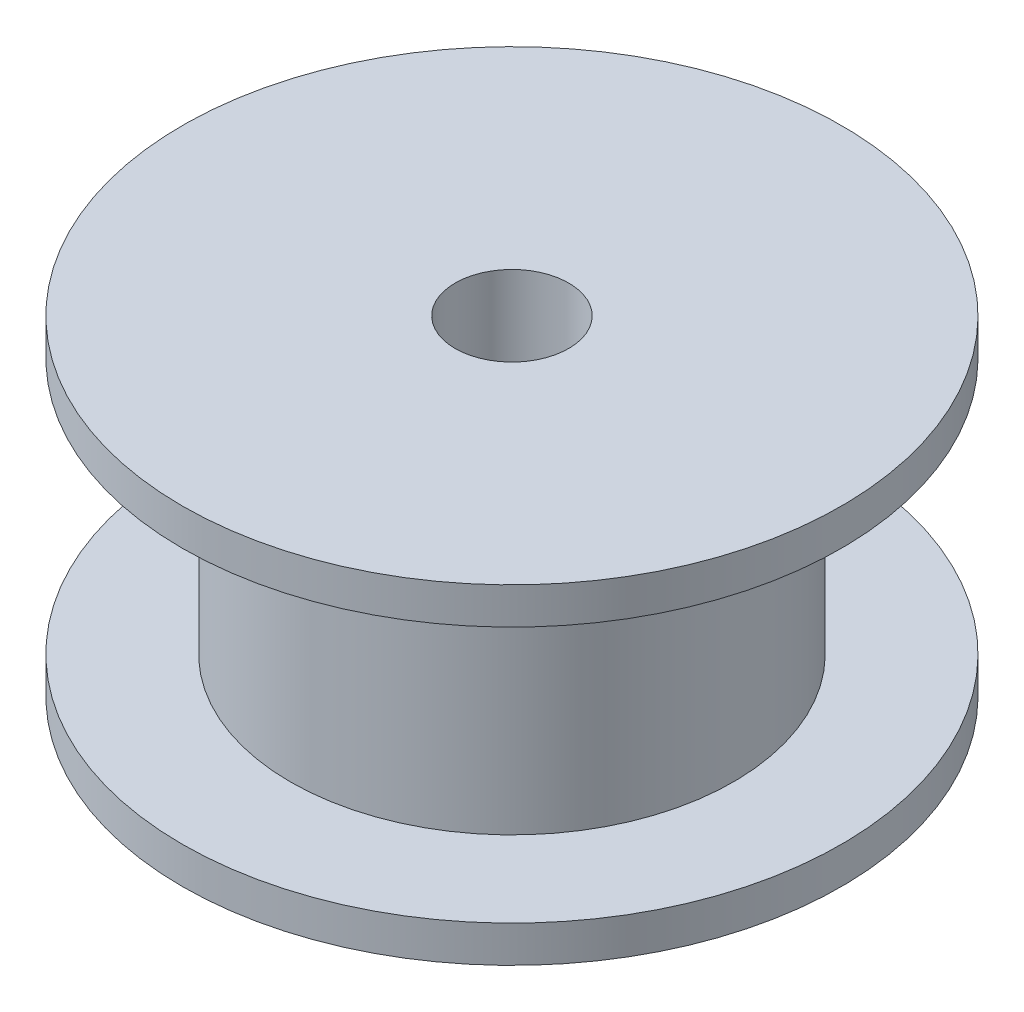
ISO-10303-21;
HEADER;
FILE_DESCRIPTION(('STEP AP214'),'2;1');
FILE_NAME('part.step','',(''),(''),'','','');
FILE_SCHEMA(('AUTOMOTIVE_DESIGN { 1 0 10303 214 1 1 1 1 }'));
ENDSEC;
DATA;
#1=APPLICATION_CONTEXT('core data for automotive mechanical design processes');
#2=APPLICATION_PROTOCOL_DEFINITION('international standard','automotive_design',2000,#1);
#3=PRODUCT_CONTEXT('',#1,'mechanical');
#4=PRODUCT('Part','Part','',(#3));
#5=PRODUCT_RELATED_PRODUCT_CATEGORY('part','',(#4));
#6=PRODUCT_DEFINITION_FORMATION('','',#4);
#7=PRODUCT_DEFINITION_CONTEXT('part definition',#1,'design');
#8=PRODUCT_DEFINITION('design','',#6,#7);
#9=PRODUCT_DEFINITION_SHAPE('','',#8);
#10=(LENGTH_UNIT() NAMED_UNIT(*) SI_UNIT(.MILLI.,.METRE.));
#11=(NAMED_UNIT(*) PLANE_ANGLE_UNIT() SI_UNIT($,.RADIAN.));
#12=(NAMED_UNIT(*) SI_UNIT($,.STERADIAN.) SOLID_ANGLE_UNIT());
#13=UNCERTAINTY_MEASURE_WITH_UNIT(LENGTH_MEASURE(1.E-05),#10,'distance_accuracy_value','');
#14=(GEOMETRIC_REPRESENTATION_CONTEXT(3) GLOBAL_UNCERTAINTY_ASSIGNED_CONTEXT((#13)) GLOBAL_UNIT_ASSIGNED_CONTEXT((#10,
#11,#12)) REPRESENTATION_CONTEXT('',''));
#15=CARTESIAN_POINT('',(0.,0.,0.));
#16=DIRECTION('',(0.,0.,1.));
#17=DIRECTION('',(1.,0.,0.));
#18=AXIS2_PLACEMENT_3D('',#15,#16,#17);
#19=CARTESIAN_POINT('',(0.,1.,0.));
#20=DIRECTION('',(0.,1.,0.));
#21=DIRECTION('',(0.,0.,1.));
#22=AXIS2_PLACEMENT_3D('',#19,#20,#21);
#23=PLANE('',#22);
#24=CARTESIAN_POINT('',(0.,1.,0.));
#25=DIRECTION('',(0.,1.,0.));
#26=DIRECTION('',(0.,0.,1.));
#27=AXIS2_PLACEMENT_3D('',#24,#25,#26);
#28=CIRCLE('',#27,9.);
#29=CARTESIAN_POINT('',(0.,1.,9.));
#30=VERTEX_POINT('',#29);
#31=EDGE_CURVE('E11',#30,#30,#28,.T.);
#32=ORIENTED_EDGE('',*,*,#31,.T.);
#33=EDGE_LOOP('',(#32));
#34=FACE_BOUND('',#33,.T.);
#35=CARTESIAN_POINT('',(0.,1.,0.));
#36=DIRECTION('',(0.,1.,0.));
#37=DIRECTION('',(0.,0.,1.));
#38=AXIS2_PLACEMENT_3D('',#35,#36,#37);
#39=CIRCLE('',#38,6.05);
#40=CARTESIAN_POINT('',(0.,1.,6.05));
#41=VERTEX_POINT('',#40);
#42=EDGE_CURVE('E52',#41,#41,#39,.F.);
#43=ORIENTED_EDGE('',*,*,#42,.T.);
#44=EDGE_LOOP('',(#43));
#45=FACE_BOUND('',#44,.T.);
#46=ADVANCED_FACE('F38',(#34,#45),#23,.T.);
#47=CARTESIAN_POINT('',(0.,1.,0.));
#48=DIRECTION('',(0.,-1.,0.));
#49=DIRECTION('',(0.,0.,-1.));
#50=AXIS2_PLACEMENT_3D('',#47,#48,#49);
#51=CYLINDRICAL_SURFACE('',#50,1.55);
#52=CARTESIAN_POINT('',(0.,0.,0.));
#53=DIRECTION('',(0.,1.,0.));
#54=DIRECTION('',(0.,0.,1.));
#55=AXIS2_PLACEMENT_3D('',#52,#53,#54);
#56=CIRCLE('',#55,1.55);
#57=CARTESIAN_POINT('',(0.,0.,1.55));
#58=VERTEX_POINT('',#57);
#59=EDGE_CURVE('E50',#58,#58,#56,.T.);
#60=ORIENTED_EDGE('',*,*,#59,.F.);
#61=EDGE_LOOP('',(#60));
#62=FACE_BOUND('',#61,.T.);
#63=CARTESIAN_POINT('',(0.,9.,0.));
#64=DIRECTION('',(0.,1.,0.));
#65=DIRECTION('',(0.,0.,1.));
#66=AXIS2_PLACEMENT_3D('',#63,#64,#65);
#67=CIRCLE('',#66,1.55);
#68=CARTESIAN_POINT('',(0.,9.,1.55));
#69=VERTEX_POINT('',#68);
#70=EDGE_CURVE('E62',#69,#69,#67,.F.);
#71=ORIENTED_EDGE('',*,*,#70,.F.);
#72=EDGE_LOOP('',(#71));
#73=FACE_BOUND('',#72,.T.);
#74=ADVANCED_FACE('F40',(#62,#73),#51,.F.);
#75=CARTESIAN_POINT('',(0.,1.,0.));
#76=DIRECTION('',(0.,-1.,0.));
#77=DIRECTION('',(0.,0.,-1.));
#78=AXIS2_PLACEMENT_3D('',#75,#76,#77);
#79=CYLINDRICAL_SURFACE('',#78,9.);
#80=ORIENTED_EDGE('',*,*,#31,.F.);
#81=EDGE_LOOP('',(#80));
#82=FACE_BOUND('',#81,.T.);
#83=CARTESIAN_POINT('',(0.,0.,0.));
#84=DIRECTION('',(0.,1.,0.));
#85=DIRECTION('',(0.,0.,1.));
#86=AXIS2_PLACEMENT_3D('',#83,#84,#85);
#87=CIRCLE('',#86,9.);
#88=CARTESIAN_POINT('',(0.,0.,9.));
#89=VERTEX_POINT('',#88);
#90=EDGE_CURVE('E42',#89,#89,#87,.T.);
#91=ORIENTED_EDGE('',*,*,#90,.T.);
#92=EDGE_LOOP('',(#91));
#93=FACE_BOUND('',#92,.T.);
#94=ADVANCED_FACE('F97',(#82,#93),#79,.T.);
#95=CARTESIAN_POINT('',(0.,0.,0.));
#96=DIRECTION('',(0.,1.,0.));
#97=DIRECTION('',(0.,0.,1.));
#98=AXIS2_PLACEMENT_3D('',#95,#96,#97);
#99=PLANE('',#98);
#100=ORIENTED_EDGE('',*,*,#59,.T.);
#101=EDGE_LOOP('',(#100));
#102=FACE_BOUND('',#101,.T.);
#103=ORIENTED_EDGE('',*,*,#90,.F.);
#104=EDGE_LOOP('',(#103));
#105=FACE_BOUND('',#104,.T.);
#106=ADVANCED_FACE('F101',(#102,#105),#99,.F.);
#107=CARTESIAN_POINT('',(0.,8.,0.));
#108=DIRECTION('',(0.,-1.,0.));
#109=DIRECTION('',(0.,0.,-1.));
#110=AXIS2_PLACEMENT_3D('',#107,#108,#109);
#111=CYLINDRICAL_SURFACE('',#110,6.05);
#112=ORIENTED_EDGE('',*,*,#42,.F.);
#113=EDGE_LOOP('',(#112));
#114=FACE_BOUND('',#113,.T.);
#115=CARTESIAN_POINT('',(0.,8.,0.));
#116=DIRECTION('',(0.,1.,0.));
#117=DIRECTION('',(0.,0.,1.));
#118=AXIS2_PLACEMENT_3D('',#115,#116,#117);
#119=CIRCLE('',#118,6.05);
#120=CARTESIAN_POINT('',(0.,8.,6.05));
#121=VERTEX_POINT('',#120);
#122=EDGE_CURVE('E58',#121,#121,#119,.T.);
#123=ORIENTED_EDGE('',*,*,#122,.F.);
#124=EDGE_LOOP('',(#123));
#125=FACE_BOUND('',#124,.T.);
#126=ADVANCED_FACE('F81',(#114,#125),#111,.T.);
#127=CARTESIAN_POINT('',(0.,9.,0.));
#128=DIRECTION('',(0.,-1.,0.));
#129=DIRECTION('',(0.,0.,-1.));
#130=AXIS2_PLACEMENT_3D('',#127,#128,#129);
#131=CYLINDRICAL_SURFACE('',#130,9.);
#132=CARTESIAN_POINT('',(0.,9.,0.));
#133=DIRECTION('',(0.,1.,0.));
#134=DIRECTION('',(0.,0.,1.));
#135=AXIS2_PLACEMENT_3D('',#132,#133,#134);
#136=CIRCLE('',#135,9.);
#137=CARTESIAN_POINT('',(0.,9.,9.));
#138=VERTEX_POINT('',#137);
#139=EDGE_CURVE('E66',#138,#138,#136,.T.);
#140=ORIENTED_EDGE('',*,*,#139,.F.);
#141=EDGE_LOOP('',(#140));
#142=FACE_BOUND('',#141,.T.);
#143=CARTESIAN_POINT('',(0.,8.,0.));
#144=DIRECTION('',(0.,1.,0.));
#145=DIRECTION('',(0.,0.,1.));
#146=AXIS2_PLACEMENT_3D('',#143,#144,#145);
#147=CIRCLE('',#146,9.);
#148=CARTESIAN_POINT('',(0.,8.,9.));
#149=VERTEX_POINT('',#148);
#150=EDGE_CURVE('E69',#149,#149,#147,.T.);
#151=ORIENTED_EDGE('',*,*,#150,.T.);
#152=EDGE_LOOP('',(#151));
#153=FACE_BOUND('',#152,.T.);
#154=ADVANCED_FACE('F78',(#142,#153),#131,.T.);
#155=CARTESIAN_POINT('',(0.,9.,0.));
#156=DIRECTION('',(0.,1.,0.));
#157=DIRECTION('',(0.,0.,1.));
#158=AXIS2_PLACEMENT_3D('',#155,#156,#157);
#159=PLANE('',#158);
#160=ORIENTED_EDGE('',*,*,#139,.T.);
#161=EDGE_LOOP('',(#160));
#162=FACE_BOUND('',#161,.T.);
#163=ORIENTED_EDGE('',*,*,#70,.T.);
#164=EDGE_LOOP('',(#163));
#165=FACE_BOUND('',#164,.T.);
#166=ADVANCED_FACE('F75',(#162,#165),#159,.T.);
#167=CARTESIAN_POINT('',(0.,8.,0.));
#168=DIRECTION('',(0.,1.,0.));
#169=DIRECTION('',(0.,0.,1.));
#170=AXIS2_PLACEMENT_3D('',#167,#168,#169);
#171=PLANE('',#170);
#172=ORIENTED_EDGE('',*,*,#122,.T.);
#173=EDGE_LOOP('',(#172));
#174=FACE_BOUND('',#173,.T.);
#175=ORIENTED_EDGE('',*,*,#150,.F.);
#176=EDGE_LOOP('',(#175));
#177=FACE_BOUND('',#176,.T.);
#178=ADVANCED_FACE('F85',(#174,#177),#171,.F.);
#179=CLOSED_SHELL('',(#46,#74,#94,#106,#126,#154,#166,#178));
#180=MANIFOLD_SOLID_BREP('B2',#179);
#181=ADVANCED_BREP_SHAPE_REPRESENTATION('',(#18,#180),#14);
#182=SHAPE_DEFINITION_REPRESENTATION(#9,#181);
ENDSEC;
END-ISO-10303-21;
